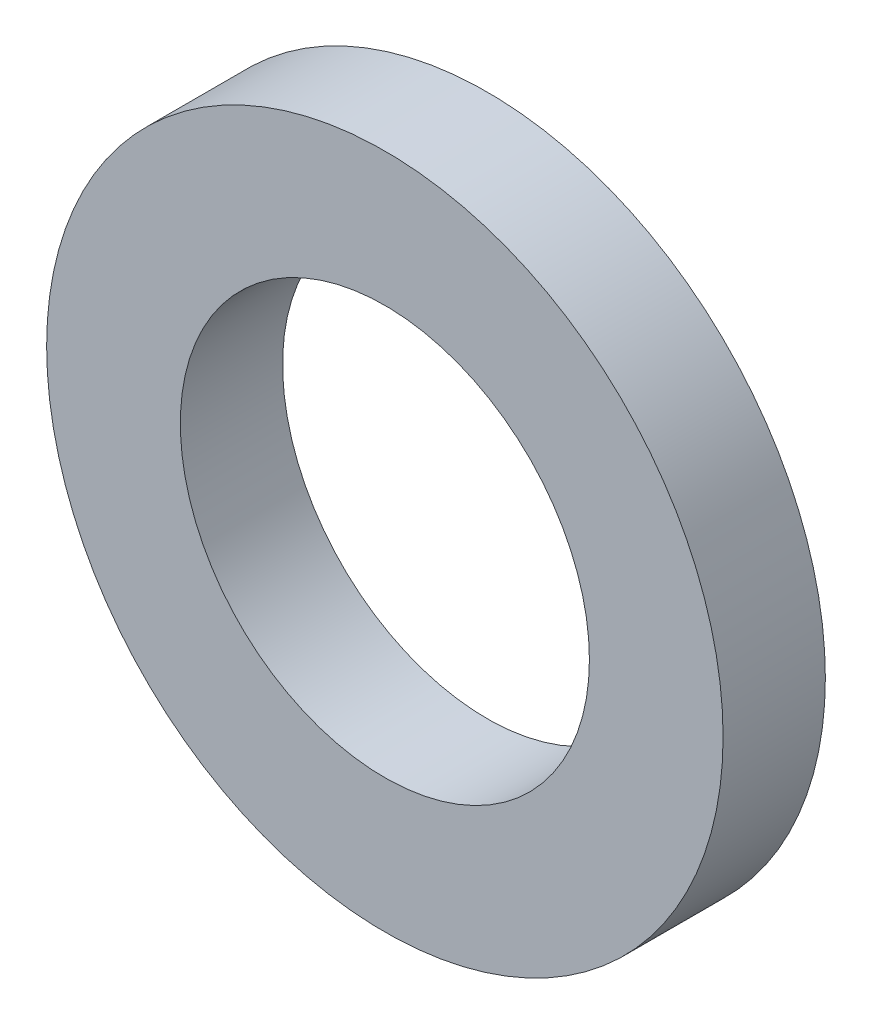
ISO-10303-21;
HEADER;
FILE_DESCRIPTION(('STEP AP214'),'2;1');
FILE_NAME('part.step','',(''),(''),'','','');
FILE_SCHEMA(('AUTOMOTIVE_DESIGN { 1 0 10303 214 1 1 1 1 }'));
ENDSEC;
DATA;
#1=APPLICATION_CONTEXT('core data for automotive mechanical design processes');
#2=APPLICATION_PROTOCOL_DEFINITION('international standard','automotive_design',2000,#1);
#3=PRODUCT_CONTEXT('',#1,'mechanical');
#4=PRODUCT('Part','Part','',(#3));
#5=PRODUCT_RELATED_PRODUCT_CATEGORY('part','',(#4));
#6=PRODUCT_DEFINITION_FORMATION('','',#4);
#7=PRODUCT_DEFINITION_CONTEXT('part definition',#1,'design');
#8=PRODUCT_DEFINITION('design','',#6,#7);
#9=PRODUCT_DEFINITION_SHAPE('','',#8);
#10=(LENGTH_UNIT() NAMED_UNIT(*) SI_UNIT(.MILLI.,.METRE.));
#11=(NAMED_UNIT(*) PLANE_ANGLE_UNIT() SI_UNIT($,.RADIAN.));
#12=(NAMED_UNIT(*) SI_UNIT($,.STERADIAN.) SOLID_ANGLE_UNIT());
#13=UNCERTAINTY_MEASURE_WITH_UNIT(LENGTH_MEASURE(1.E-05),#10,'distance_accuracy_value','');
#14=(GEOMETRIC_REPRESENTATION_CONTEXT(3) GLOBAL_UNCERTAINTY_ASSIGNED_CONTEXT((#13)) GLOBAL_UNIT_ASSIGNED_CONTEXT((#10,
#11,#12)) REPRESENTATION_CONTEXT('',''));
#15=CARTESIAN_POINT('',(0.,0.,0.));
#16=DIRECTION('',(0.,0.,1.));
#17=DIRECTION('',(1.,0.,0.));
#18=AXIS2_PLACEMENT_3D('',#15,#16,#17);
#19=CARTESIAN_POINT('',(0.,0.,-3.175));
#20=DIRECTION('',(0.,0.,-1.));
#21=DIRECTION('',(1.,0.,0.));
#22=AXIS2_PLACEMENT_3D('',#19,#20,#21);
#23=PLANE('',#22);
#24=CARTESIAN_POINT('',(0.,0.,-3.175));
#25=DIRECTION('',(0.,0.,1.));
#26=DIRECTION('',(1.,0.,0.));
#27=AXIS2_PLACEMENT_3D('',#24,#25,#26);
#28=CIRCLE('',#27,10.5);
#29=CARTESIAN_POINT('',(10.5,0.,-3.175));
#30=VERTEX_POINT('',#29);
#31=EDGE_CURVE('E10',#30,#30,#28,.T.);
#32=ORIENTED_EDGE('',*,*,#31,.F.);
#33=EDGE_LOOP('',(#32));
#34=FACE_BOUND('',#33,.T.);
#35=CARTESIAN_POINT('',(0.,0.,-3.175));
#36=DIRECTION('',(0.,0.,1.));
#37=DIRECTION('',(1.,0.,0.));
#38=AXIS2_PLACEMENT_3D('',#35,#36,#37);
#39=CIRCLE('',#38,6.35);
#40=CARTESIAN_POINT('',(6.35,0.,-3.175));
#41=VERTEX_POINT('',#40);
#42=EDGE_CURVE('E50',#41,#41,#39,.T.);
#43=ORIENTED_EDGE('',*,*,#42,.T.);
#44=EDGE_LOOP('',(#43));
#45=FACE_BOUND('',#44,.T.);
#46=ADVANCED_FACE('F39',(#34,#45),#23,.T.);
#47=CARTESIAN_POINT('',(0.,0.,0.));
#48=DIRECTION('',(0.,0.,-1.));
#49=DIRECTION('',(1.,0.,0.));
#50=AXIS2_PLACEMENT_3D('',#47,#48,#49);
#51=PLANE('',#50);
#52=CARTESIAN_POINT('',(0.,0.,0.));
#53=DIRECTION('',(0.,0.,1.));
#54=DIRECTION('',(1.,0.,0.));
#55=AXIS2_PLACEMENT_3D('',#52,#53,#54);
#56=CIRCLE('',#55,10.5);
#57=CARTESIAN_POINT('',(10.5,0.,0.));
#58=VERTEX_POINT('',#57);
#59=EDGE_CURVE('E43',#58,#58,#56,.T.);
#60=ORIENTED_EDGE('',*,*,#59,.T.);
#61=EDGE_LOOP('',(#60));
#62=FACE_BOUND('',#61,.T.);
#63=CARTESIAN_POINT('',(0.,0.,0.));
#64=DIRECTION('',(0.,0.,1.));
#65=DIRECTION('',(1.,0.,0.));
#66=AXIS2_PLACEMENT_3D('',#63,#64,#65);
#67=CIRCLE('',#66,6.35);
#68=CARTESIAN_POINT('',(6.35,0.,0.));
#69=VERTEX_POINT('',#68);
#70=EDGE_CURVE('E52',#69,#69,#67,.T.);
#71=ORIENTED_EDGE('',*,*,#70,.F.);
#72=EDGE_LOOP('',(#71));
#73=FACE_BOUND('',#72,.T.);
#74=ADVANCED_FACE('F65',(#62,#73),#51,.F.);
#75=CARTESIAN_POINT('',(0.,0.,-3.175));
#76=DIRECTION('',(0.,0.,1.));
#77=DIRECTION('',(-1.,0.,0.));
#78=AXIS2_PLACEMENT_3D('',#75,#76,#77);
#79=CYLINDRICAL_SURFACE('',#78,10.5);
#80=ORIENTED_EDGE('',*,*,#31,.T.);
#81=EDGE_LOOP('',(#80));
#82=FACE_BOUND('',#81,.T.);
#83=ORIENTED_EDGE('',*,*,#59,.F.);
#84=EDGE_LOOP('',(#83));
#85=FACE_BOUND('',#84,.T.);
#86=ADVANCED_FACE('F41',(#82,#85),#79,.T.);
#87=CARTESIAN_POINT('',(0.,0.,-3.175));
#88=DIRECTION('',(0.,0.,1.));
#89=DIRECTION('',(-1.,0.,0.));
#90=AXIS2_PLACEMENT_3D('',#87,#88,#89);
#91=CYLINDRICAL_SURFACE('',#90,6.35);
#92=ORIENTED_EDGE('',*,*,#42,.F.);
#93=EDGE_LOOP('',(#92));
#94=FACE_BOUND('',#93,.T.);
#95=ORIENTED_EDGE('',*,*,#70,.T.);
#96=EDGE_LOOP('',(#95));
#97=FACE_BOUND('',#96,.T.);
#98=ADVANCED_FACE('F59',(#94,#97),#91,.F.);
#99=CLOSED_SHELL('',(#46,#74,#86,#98));
#100=MANIFOLD_SOLID_BREP('B2',#99);
#101=ADVANCED_BREP_SHAPE_REPRESENTATION('',(#18,#100),#14);
#102=SHAPE_DEFINITION_REPRESENTATION(#9,#101);
ENDSEC;
END-ISO-10303-21;
